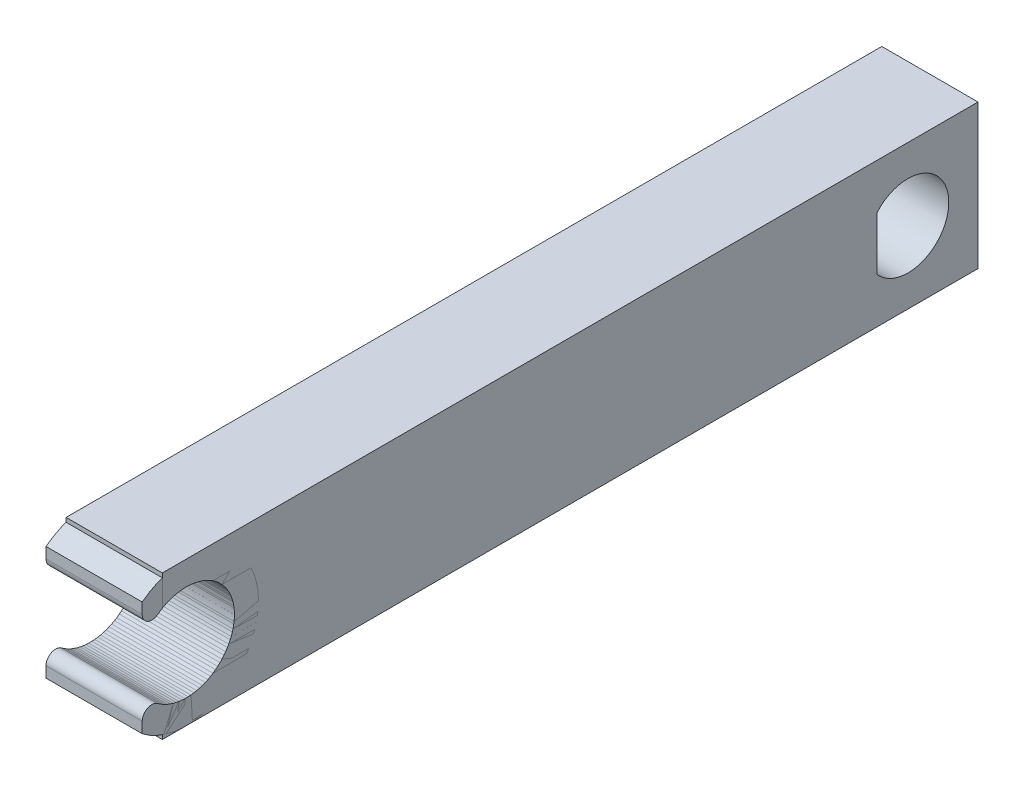
ISO-10303-21;
HEADER;
FILE_DESCRIPTION(('STEP AP214'),'2;1');
FILE_NAME('part.step','',(''),(''),'','','');
FILE_SCHEMA(('AUTOMOTIVE_DESIGN { 1 0 10303 214 1 1 1 1 }'));
ENDSEC;
DATA;
#1=APPLICATION_CONTEXT('core data for automotive mechanical design processes');
#2=APPLICATION_PROTOCOL_DEFINITION('international standard','automotive_design',2000,#1);
#3=PRODUCT_CONTEXT('',#1,'mechanical');
#4=PRODUCT('Part','Part','',(#3));
#5=PRODUCT_RELATED_PRODUCT_CATEGORY('part','',(#4));
#6=PRODUCT_DEFINITION_FORMATION('','',#4);
#7=PRODUCT_DEFINITION_CONTEXT('part definition',#1,'design');
#8=PRODUCT_DEFINITION('design','',#6,#7);
#9=PRODUCT_DEFINITION_SHAPE('','',#8);
#10=(LENGTH_UNIT() NAMED_UNIT(*) SI_UNIT(.MILLI.,.METRE.));
#11=(NAMED_UNIT(*) PLANE_ANGLE_UNIT() SI_UNIT($,.RADIAN.));
#12=(NAMED_UNIT(*) SI_UNIT($,.STERADIAN.) SOLID_ANGLE_UNIT());
#13=UNCERTAINTY_MEASURE_WITH_UNIT(LENGTH_MEASURE(1.E-05),#10,'distance_accuracy_value','');
#14=(GEOMETRIC_REPRESENTATION_CONTEXT(3) GLOBAL_UNCERTAINTY_ASSIGNED_CONTEXT((#13)) GLOBAL_UNIT_ASSIGNED_CONTEXT((#10,
#11,#12)) REPRESENTATION_CONTEXT('',''));
#15=CARTESIAN_POINT('',(0.,0.,0.));
#16=DIRECTION('',(0.,0.,1.));
#17=DIRECTION('',(1.,0.,0.));
#18=AXIS2_PLACEMENT_3D('',#15,#16,#17);
#19=CARTESIAN_POINT('',(-2.40602130027024,-18.3317262756318,80.));
#20=DIRECTION('',(-1.,0.,0.));
#21=DIRECTION('',(0.,-1.,0.));
#22=AXIS2_PLACEMENT_3D('',#19,#20,#21);
#23=CYLINDRICAL_SURFACE('',#22,6.);
#24=DIRECTION('',(-1.,0.,0.));
#25=VECTOR('',#24,1.);
#26=CARTESIAN_POINT('',(-2.40602130027024,-23.0751979656583,83.6741633504673));
#27=LINE('',#26,#25);
#28=CARTESIAN_POINT('',(-10.4060213002702,-23.0751979656583,83.6741633504673));
#29=VERTEX_POINT('',#28);
#30=CARTESIAN_POINT('',(-2.40602130027024,-23.0751979656583,83.6741633504673));
#31=VERTEX_POINT('',#30);
#32=EDGE_CURVE('E127',#29,#31,#27,.F.);
#33=ORIENTED_EDGE('',*,*,#32,.F.);
#34=CARTESIAN_POINT('',(-10.4060213002702,-18.3317262756318,80.));
#35=DIRECTION('',(-1.,0.,0.));
#36=DIRECTION('',(0.,-1.,0.));
#37=AXIS2_PLACEMENT_3D('',#34,#35,#36);
#38=CIRCLE('',#37,6.);
#39=CARTESIAN_POINT('',(-10.4060213002702,-13.5882545856054,83.6741633504673));
#40=VERTEX_POINT('',#39);
#41=EDGE_CURVE('E122',#40,#29,#38,.T.);
#42=ORIENTED_EDGE('',*,*,#41,.F.);
#43=DIRECTION('',(-1.,0.,0.));
#44=VECTOR('',#43,1.);
#45=CARTESIAN_POINT('',(-2.40602130027024,-13.5882545856054,83.6741633504673));
#46=LINE('',#45,#44);
#47=CARTESIAN_POINT('',(-2.40602130027024,-13.5882545856054,83.6741633504673));
#48=VERTEX_POINT('',#47);
#49=EDGE_CURVE('E108',#48,#40,#46,.T.);
#50=ORIENTED_EDGE('',*,*,#49,.F.);
#51=CARTESIAN_POINT('',(-2.40602130027024,-18.3317262756318,80.));
#52=DIRECTION('',(-1.,0.,0.));
#53=DIRECTION('',(0.,-1.,0.));
#54=AXIS2_PLACEMENT_3D('',#51,#52,#53);
#55=CIRCLE('',#54,6.);
#56=EDGE_CURVE('E128',#48,#31,#55,.T.);
#57=ORIENTED_EDGE('',*,*,#56,.T.);
#58=EDGE_LOOP('',(#33,#42,#50,#57));
#59=FACE_BOUND('',#58,.T.);
#60=ADVANCED_FACE('F55',(#59),#23,.T.);
#61=CARTESIAN_POINT('',(-2.40602130027024,-18.3317262756318,80.));
#62=DIRECTION('',(-1.,0.,0.));
#63=DIRECTION('',(0.,-1.,0.));
#64=AXIS2_PLACEMENT_3D('',#61,#62,#63);
#65=PLANE('',#64);
#66=CARTESIAN_POINT('',(-2.40602130027024,-18.3317262756318,80.));
#67=DIRECTION('',(-1.,0.,0.));
#68=DIRECTION('',(0.,-1.,0.));
#69=AXIS2_PLACEMENT_3D('',#66,#67,#68);
#70=CIRCLE('',#69,4.00000000000001);
#71=CARTESIAN_POINT('',(-2.40602130027024,-15.1280841388047,82.3951361253894));
#72=VERTEX_POINT('',#71);
#73=CARTESIAN_POINT('',(-2.40602130027024,-21.535368412459,82.3951361253894));
#74=VERTEX_POINT('',#73);
#75=EDGE_CURVE('E129',#72,#74,#70,.T.);
#76=ORIENTED_EDGE('',*,*,#75,.T.);
#77=CARTESIAN_POINT('',(-2.40602130027024,-22.1760968398244,82.8741633504673));
#78=DIRECTION('',(-1.,0.,0.));
#79=DIRECTION('',(0.,-1.,0.));
#80=AXIS2_PLACEMENT_3D('',#77,#78,#79);
#81=CIRCLE('',#80,0.8);
#82=CARTESIAN_POINT('',(-2.40602130027024,-22.1760968398244,83.6741633504673));
#83=VERTEX_POINT('',#82);
#84=EDGE_CURVE('E145',#74,#83,#81,.F.);
#85=ORIENTED_EDGE('',*,*,#84,.T.);
#86=DIRECTION('',(0.,-1.,0.));
#87=VECTOR('',#86,1.);
#88=CARTESIAN_POINT('',(-2.40602130027024,-18.3317262756318,83.6741633504673));
#89=LINE('',#88,#87);
#90=EDGE_CURVE('E118',#83,#31,#89,.T.);
#91=ORIENTED_EDGE('',*,*,#90,.T.);
#92=ORIENTED_EDGE('',*,*,#56,.F.);
#93=CARTESIAN_POINT('',(-2.40602130027024,-14.4873557114392,83.6741633504673));
#94=VERTEX_POINT('',#93);
#95=EDGE_CURVE('E113',#48,#94,#89,.T.);
#96=ORIENTED_EDGE('',*,*,#95,.T.);
#97=CARTESIAN_POINT('',(-2.40602130027024,-14.4873557114392,82.8741633504673));
#98=DIRECTION('',(-1.,0.,0.));
#99=DIRECTION('',(0.,-1.,0.));
#100=AXIS2_PLACEMENT_3D('',#97,#98,#99);
#101=CIRCLE('',#100,0.8);
#102=EDGE_CURVE('E143',#94,#72,#101,.F.);
#103=ORIENTED_EDGE('',*,*,#102,.T.);
#104=EDGE_LOOP('',(#76,#85,#91,#92,#96,#103));
#105=FACE_BOUND('',#104,.T.);
#106=ADVANCED_FACE('F158',(#105),#65,.F.);
#107=CARTESIAN_POINT('',(-10.4060213002702,-18.3317262756318,80.));
#108=DIRECTION('',(-1.,0.,0.));
#109=DIRECTION('',(0.,-1.,0.));
#110=AXIS2_PLACEMENT_3D('',#107,#108,#109);
#111=PLANE('',#110);
#112=DIRECTION('',(0.,-1.,0.));
#113=VECTOR('',#112,1.);
#114=CARTESIAN_POINT('',(-10.4060213002702,-12.3317262756318,83.6741633504673));
#115=LINE('',#114,#113);
#116=CARTESIAN_POINT('',(-10.4060213002702,-22.1760968398244,83.6741633504673));
#117=VERTEX_POINT('',#116);
#118=EDGE_CURVE('E123',#117,#29,#115,.T.);
#119=ORIENTED_EDGE('',*,*,#118,.F.);
#120=CARTESIAN_POINT('',(-10.4060213002702,-22.1760968398244,82.8741633504673));
#121=DIRECTION('',(-1.,0.,0.));
#122=DIRECTION('',(0.,-1.,0.));
#123=AXIS2_PLACEMENT_3D('',#120,#121,#122);
#124=CIRCLE('',#123,0.8);
#125=CARTESIAN_POINT('',(-10.4060213002702,-21.535368412459,82.3951361253894));
#126=VERTEX_POINT('',#125);
#127=EDGE_CURVE('E63',#117,#126,#124,.T.);
#128=ORIENTED_EDGE('',*,*,#127,.T.);
#129=CARTESIAN_POINT('',(-10.4060213002702,-18.3317262756318,80.));
#130=DIRECTION('',(-1.,0.,0.));
#131=DIRECTION('',(0.,-1.,0.));
#132=AXIS2_PLACEMENT_3D('',#129,#130,#131);
#133=CIRCLE('',#132,4.00000000000001);
#134=CARTESIAN_POINT('',(-10.4060213002702,-15.1280841388047,82.3951361253894));
#135=VERTEX_POINT('',#134);
#136=EDGE_CURVE('E134',#135,#126,#133,.T.);
#137=ORIENTED_EDGE('',*,*,#136,.F.);
#138=CARTESIAN_POINT('',(-10.4060213002702,-14.4873557114392,82.8741633504673));
#139=DIRECTION('',(-1.,0.,0.));
#140=DIRECTION('',(0.,-1.,0.));
#141=AXIS2_PLACEMENT_3D('',#138,#139,#140);
#142=CIRCLE('',#141,0.8);
#143=CARTESIAN_POINT('',(-10.4060213002702,-14.4873557114392,83.6741633504673));
#144=VERTEX_POINT('',#143);
#145=EDGE_CURVE('E70',#135,#144,#142,.T.);
#146=ORIENTED_EDGE('',*,*,#145,.T.);
#147=EDGE_CURVE('E110',#40,#144,#115,.T.);
#148=ORIENTED_EDGE('',*,*,#147,.F.);
#149=ORIENTED_EDGE('',*,*,#41,.T.);
#150=EDGE_LOOP('',(#119,#128,#137,#146,#148,#149));
#151=FACE_BOUND('',#150,.T.);
#152=ADVANCED_FACE('F121',(#151),#111,.T.);
#153=CARTESIAN_POINT('',(-2.40602130027024,-18.3317262756318,80.));
#154=DIRECTION('',(-1.,0.,0.));
#155=DIRECTION('',(0.,-1.,0.));
#156=AXIS2_PLACEMENT_3D('',#153,#154,#155);
#157=CYLINDRICAL_SURFACE('',#156,4.00000000000001);
#158=ORIENTED_EDGE('',*,*,#136,.T.);
#159=DIRECTION('',(-1.,0.,0.));
#160=VECTOR('',#159,1.);
#161=CARTESIAN_POINT('',(-2.40602130027024,-21.535368412459,82.3951361253894));
#162=LINE('',#161,#160);
#163=EDGE_CURVE('E140',#126,#74,#162,.F.);
#164=ORIENTED_EDGE('',*,*,#163,.T.);
#165=ORIENTED_EDGE('',*,*,#75,.F.);
#166=DIRECTION('',(-1.,0.,0.));
#167=VECTOR('',#166,1.);
#168=CARTESIAN_POINT('',(-2.40602130027024,-15.1280841388047,82.3951361253894));
#169=LINE('',#168,#167);
#170=EDGE_CURVE('E131',#72,#135,#169,.T.);
#171=ORIENTED_EDGE('',*,*,#170,.T.);
#172=EDGE_LOOP('',(#158,#164,#165,#171));
#173=FACE_BOUND('',#172,.T.);
#174=ADVANCED_FACE('F153',(#173),#157,.F.);
#175=CARTESIAN_POINT('',(33.5939786997298,-12.3317262756318,83.6741633504673));
#176=DIRECTION('',(0.,0.,-1.));
#177=DIRECTION('',(-1.,0.,0.));
#178=AXIS2_PLACEMENT_3D('',#175,#176,#177);
#179=PLANE('',#178);
#180=ORIENTED_EDGE('',*,*,#147,.T.);
#181=DIRECTION('',(-1.,0.,0.));
#182=VECTOR('',#181,1.);
#183=CARTESIAN_POINT('',(33.5939786997298,-14.4873557114392,83.6741633504673));
#184=LINE('',#183,#182);
#185=EDGE_CURVE('E13',#144,#94,#184,.F.);
#186=ORIENTED_EDGE('',*,*,#185,.T.);
#187=ORIENTED_EDGE('',*,*,#95,.F.);
#188=ORIENTED_EDGE('',*,*,#49,.T.);
#189=EDGE_LOOP('',(#180,#186,#187,#188));
#190=FACE_BOUND('',#189,.T.);
#191=ADVANCED_FACE('F109',(#190),#179,.F.);
#192=ORIENTED_EDGE('',*,*,#90,.F.);
#193=DIRECTION('',(-1.,0.,0.));
#194=VECTOR('',#193,1.);
#195=CARTESIAN_POINT('',(33.5939786997298,-22.1760968398244,83.6741633504673));
#196=LINE('',#195,#194);
#197=EDGE_CURVE('E78',#83,#117,#196,.T.);
#198=ORIENTED_EDGE('',*,*,#197,.T.);
#199=ORIENTED_EDGE('',*,*,#118,.T.);
#200=ORIENTED_EDGE('',*,*,#32,.T.);
#201=EDGE_LOOP('',(#192,#198,#199,#200));
#202=FACE_BOUND('',#201,.T.);
#203=ADVANCED_FACE('F159',(#202),#179,.F.);
#204=CARTESIAN_POINT('',(-2.40602130027024,-22.1760968398244,82.8741633504673));
#205=DIRECTION('',(-1.,0.,0.));
#206=DIRECTION('',(0.,-1.,0.));
#207=AXIS2_PLACEMENT_3D('',#204,#205,#206);
#208=CYLINDRICAL_SURFACE('',#207,0.8);
#209=ORIENTED_EDGE('',*,*,#127,.F.);
#210=ORIENTED_EDGE('',*,*,#197,.F.);
#211=ORIENTED_EDGE('',*,*,#84,.F.);
#212=ORIENTED_EDGE('',*,*,#163,.F.);
#213=EDGE_LOOP('',(#209,#210,#211,#212));
#214=FACE_BOUND('',#213,.T.);
#215=ADVANCED_FACE('F156',(#214),#208,.T.);
#216=CARTESIAN_POINT('',(-2.40602130027024,-14.4873557114392,82.8741633504673));
#217=DIRECTION('',(-1.,0.,0.));
#218=DIRECTION('',(0.,-1.,0.));
#219=AXIS2_PLACEMENT_3D('',#216,#217,#218);
#220=CYLINDRICAL_SURFACE('',#219,0.8);
#221=ORIENTED_EDGE('',*,*,#102,.F.);
#222=ORIENTED_EDGE('',*,*,#185,.F.);
#223=ORIENTED_EDGE('',*,*,#145,.F.);
#224=ORIENTED_EDGE('',*,*,#170,.F.);
#225=EDGE_LOOP('',(#221,#222,#223,#224));
#226=FACE_BOUND('',#225,.T.);
#227=ADVANCED_FACE('F57',(#226),#220,.T.);
#228=CLOSED_SHELL('',(#60,#106,#152,#174,#191,#203,#215,#227));
#229=MANIFOLD_SOLID_BREP('B2',#228);
#230=CARTESIAN_POINT('',(-10.4060213002702,-12.3317262756318,82.));
#231=DIRECTION('',(1.,0.,0.));
#232=DIRECTION('',(0.,1.,0.));
#233=AXIS2_PLACEMENT_3D('',#230,#231,#232);
#234=PLANE('',#233);
#235=DIRECTION('',(0.,-1.,0.));
#236=VECTOR('',#235,1.);
#237=CARTESIAN_POINT('',(-10.4060213002702,0.,22.5559386762542));
#238=LINE('',#237,#236);
#239=CARTESIAN_POINT('',(-10.4060213002702,-16.0895894637428,22.5559386762542));
#240=VERTEX_POINT('',#239);
#241=CARTESIAN_POINT('',(-10.4060213002702,-20.5738630875209,22.5559386762542));
#242=VERTEX_POINT('',#241);
#243=EDGE_CURVE('E255',#240,#242,#238,.T.);
#244=ORIENTED_EDGE('',*,*,#243,.T.);
#245=CARTESIAN_POINT('',(-10.4060213002702,-18.3317262756318,20.));
#246=DIRECTION('',(-1.,0.,0.));
#247=DIRECTION('',(0.,-1.,0.));
#248=AXIS2_PLACEMENT_3D('',#245,#246,#247);
#249=CIRCLE('',#248,3.4);
#250=EDGE_CURVE('E379',#240,#242,#249,.T.);
#251=ORIENTED_EDGE('',*,*,#250,.F.);
#252=EDGE_LOOP('',(#244,#251));
#253=FACE_BOUND('',#252,.T.);
#254=DIRECTION('',(0.,-1.,0.));
#255=VECTOR('',#254,1.);
#256=CARTESIAN_POINT('',(-10.4060213002702,0.,14.1719817502576));
#257=LINE('',#256,#255);
#258=CARTESIAN_POINT('',(-10.4060213002702,-12.3317262756318,14.1719817502576));
#259=VERTEX_POINT('',#258);
#260=CARTESIAN_POINT('',(-10.4060213002702,-24.3317262756318,14.1719817502576));
#261=VERTEX_POINT('',#260);
#262=EDGE_CURVE('E307',#259,#261,#257,.T.);
#263=ORIENTED_EDGE('',*,*,#262,.T.);
#264=DIRECTION('',(0.,0.,-1.));
#265=VECTOR('',#264,1.);
#266=CARTESIAN_POINT('',(-10.4060213002702,-24.3317262756318,82.));
#267=LINE('',#266,#265);
#268=CARTESIAN_POINT('',(-10.4060213002702,-24.3317262756318,82.));
#269=VERTEX_POINT('',#268);
#270=EDGE_CURVE('E322',#269,#261,#267,.T.);
#271=ORIENTED_EDGE('',*,*,#270,.F.);
#272=DIRECTION('',(0.,-1.,0.));
#273=VECTOR('',#272,1.);
#274=CARTESIAN_POINT('',(-10.4060213002702,-12.3317262756318,82.));
#275=LINE('',#274,#273);
#276=CARTESIAN_POINT('',(-10.4060213002702,-21.7958278907696,82.));
#277=VERTEX_POINT('',#276);
#278=EDGE_CURVE('E359',#277,#269,#275,.T.);
#279=ORIENTED_EDGE('',*,*,#278,.F.);
#280=CARTESIAN_POINT('',(-10.4060213002702,-18.3317262756318,80.));
#281=DIRECTION('',(-1.,0.,0.));
#282=DIRECTION('',(0.,-1.,0.));
#283=AXIS2_PLACEMENT_3D('',#280,#281,#282);
#284=CIRCLE('',#283,4.00000000000001);
#285=CARTESIAN_POINT('',(-10.4060213002702,-14.8676246604941,82.));
#286=VERTEX_POINT('',#285);
#287=EDGE_CURVE('E368',#286,#277,#284,.T.);
#288=ORIENTED_EDGE('',*,*,#287,.F.);
#289=CARTESIAN_POINT('',(-10.4060213002702,-12.3317262756318,82.));
#290=VERTEX_POINT('',#289);
#291=EDGE_CURVE('E355',#290,#286,#275,.T.);
#292=ORIENTED_EDGE('',*,*,#291,.F.);
#293=DIRECTION('',(0.,0.,-1.));
#294=VECTOR('',#293,1.);
#295=CARTESIAN_POINT('',(-10.4060213002702,-12.3317262756318,82.));
#296=LINE('',#295,#294);
#297=EDGE_CURVE('E325',#290,#259,#296,.T.);
#298=ORIENTED_EDGE('',*,*,#297,.T.);
#299=EDGE_LOOP('',(#263,#271,#279,#288,#292,#298));
#300=FACE_BOUND('',#299,.T.);
#301=ADVANCED_FACE('F240',(#253,#300),#234,.F.);
#302=CARTESIAN_POINT('',(-10.4060213002702,-24.3317262756318,82.));
#303=DIRECTION('',(0.,1.,0.));
#304=DIRECTION('',(0.,0.,1.));
#305=AXIS2_PLACEMENT_3D('',#302,#303,#304);
#306=PLANE('',#305);
#307=DIRECTION('',(-1.,0.,0.));
#308=VECTOR('',#307,1.);
#309=CARTESIAN_POINT('',(-0.406021300270239,-24.3317262756318,14.1719817502576));
#310=LINE('',#309,#308);
#311=CARTESIAN_POINT('',(-2.40602130027024,-24.3317262756318,14.1719817502576));
#312=VERTEX_POINT('',#311);
#313=EDGE_CURVE('E304',#312,#261,#310,.T.);
#314=ORIENTED_EDGE('',*,*,#313,.F.);
#315=DIRECTION('',(0.,0.,-1.));
#316=VECTOR('',#315,1.);
#317=CARTESIAN_POINT('',(-2.40602130027024,-24.3317262756318,82.));
#318=LINE('',#317,#316);
#319=CARTESIAN_POINT('',(-2.40602130027024,-24.3317262756318,82.));
#320=VERTEX_POINT('',#319);
#321=EDGE_CURVE('E332',#320,#312,#318,.T.);
#322=ORIENTED_EDGE('',*,*,#321,.F.);
#323=DIRECTION('',(1.,0.,0.));
#324=VECTOR('',#323,1.);
#325=CARTESIAN_POINT('',(-10.4060213002702,-24.3317262756318,82.));
#326=LINE('',#325,#324);
#327=EDGE_CURVE('E330',#269,#320,#326,.T.);
#328=ORIENTED_EDGE('',*,*,#327,.F.);
#329=ORIENTED_EDGE('',*,*,#270,.T.);
#330=EDGE_LOOP('',(#314,#322,#328,#329));
#331=FACE_BOUND('',#330,.T.);
#332=ADVANCED_FACE('F329',(#331),#306,.F.);
#333=CARTESIAN_POINT('',(-2.40602130027024,-12.3317262756318,82.));
#334=DIRECTION('',(-1.,0.,0.));
#335=DIRECTION('',(0.,-1.,0.));
#336=AXIS2_PLACEMENT_3D('',#333,#334,#335);
#337=PLANE('',#336);
#338=DIRECTION('',(0.,-1.,0.));
#339=VECTOR('',#338,1.);
#340=CARTESIAN_POINT('',(-2.40602130027024,-12.3317262756318,22.5559386762542));
#341=LINE('',#340,#339);
#342=CARTESIAN_POINT('',(-2.40602130027024,-16.0895894637428,22.5559386762542));
#343=VERTEX_POINT('',#342);
#344=CARTESIAN_POINT('',(-2.40602130027024,-20.5738630875209,22.5559386762542));
#345=VERTEX_POINT('',#344);
#346=EDGE_CURVE('E53',#343,#345,#341,.T.);
#347=ORIENTED_EDGE('',*,*,#346,.F.);
#348=CARTESIAN_POINT('',(-2.40602130027024,-18.3317262756318,20.));
#349=DIRECTION('',(-1.,0.,0.));
#350=DIRECTION('',(0.,-1.,0.));
#351=AXIS2_PLACEMENT_3D('',#348,#349,#350);
#352=CIRCLE('',#351,3.4);
#353=EDGE_CURVE('E248',#343,#345,#352,.T.);
#354=ORIENTED_EDGE('',*,*,#353,.T.);
#355=EDGE_LOOP('',(#347,#354));
#356=FACE_BOUND('',#355,.T.);
#357=DIRECTION('',(0.,-1.,0.));
#358=VECTOR('',#357,1.);
#359=CARTESIAN_POINT('',(-2.40602130027024,-12.3317262756318,14.1719817502576));
#360=LINE('',#359,#358);
#361=CARTESIAN_POINT('',(-2.40602130027024,-12.3317262756318,14.1719817502576));
#362=VERTEX_POINT('',#361);
#363=EDGE_CURVE('E310',#362,#312,#360,.T.);
#364=ORIENTED_EDGE('',*,*,#363,.F.);
#365=DIRECTION('',(0.,0.,-1.));
#366=VECTOR('',#365,1.);
#367=CARTESIAN_POINT('',(-2.40602130027024,-12.3317262756318,82.));
#368=LINE('',#367,#366);
#369=CARTESIAN_POINT('',(-2.40602130027024,-12.3317262756318,82.));
#370=VERTEX_POINT('',#369);
#371=EDGE_CURVE('E337',#370,#362,#368,.T.);
#372=ORIENTED_EDGE('',*,*,#371,.F.);
#373=DIRECTION('',(0.,1.,0.));
#374=VECTOR('',#373,1.);
#375=CARTESIAN_POINT('',(-2.40602130027024,-12.3317262756318,82.));
#376=LINE('',#375,#374);
#377=CARTESIAN_POINT('',(-2.40602130027024,-14.8676246604941,82.));
#378=VERTEX_POINT('',#377);
#379=EDGE_CURVE('E352',#378,#370,#376,.T.);
#380=ORIENTED_EDGE('',*,*,#379,.F.);
#381=CARTESIAN_POINT('',(-2.40602130027024,-18.3317262756318,80.));
#382=DIRECTION('',(-1.,0.,0.));
#383=DIRECTION('',(0.,-1.,0.));
#384=AXIS2_PLACEMENT_3D('',#381,#382,#383);
#385=CIRCLE('',#384,4.00000000000001);
#386=CARTESIAN_POINT('',(-2.40602130027024,-21.7958278907696,82.));
#387=VERTEX_POINT('',#386);
#388=EDGE_CURVE('E364',#378,#387,#385,.T.);
#389=ORIENTED_EDGE('',*,*,#388,.T.);
#390=EDGE_CURVE('E348',#320,#387,#376,.T.);
#391=ORIENTED_EDGE('',*,*,#390,.F.);
#392=ORIENTED_EDGE('',*,*,#321,.T.);
#393=EDGE_LOOP('',(#364,#372,#380,#389,#391,#392));
#394=FACE_BOUND('',#393,.T.);
#395=ADVANCED_FACE('F392',(#356,#394),#337,.F.);
#396=CARTESIAN_POINT('',(-10.4060213002702,-12.3317262756318,82.));
#397=DIRECTION('',(0.,-1.,0.));
#398=DIRECTION('',(0.,0.,-1.));
#399=AXIS2_PLACEMENT_3D('',#396,#397,#398);
#400=PLANE('',#399);
#401=DIRECTION('',(-1.,0.,0.));
#402=VECTOR('',#401,1.);
#403=CARTESIAN_POINT('',(-0.40602130027024,-12.3317262756318,14.1719817502576));
#404=LINE('',#403,#402);
#405=EDGE_CURVE('E316',#362,#259,#404,.T.);
#406=ORIENTED_EDGE('',*,*,#405,.T.);
#407=ORIENTED_EDGE('',*,*,#297,.F.);
#408=DIRECTION('',(-1.,0.,0.));
#409=VECTOR('',#408,1.);
#410=CARTESIAN_POINT('',(-10.4060213002702,-12.3317262756318,82.));
#411=LINE('',#410,#409);
#412=EDGE_CURVE('E345',#370,#290,#411,.T.);
#413=ORIENTED_EDGE('',*,*,#412,.F.);
#414=ORIENTED_EDGE('',*,*,#371,.T.);
#415=EDGE_LOOP('',(#406,#407,#413,#414));
#416=FACE_BOUND('',#415,.T.);
#417=ADVANCED_FACE('F388',(#416),#400,.F.);
#418=CARTESIAN_POINT('',(0.,0.,82.));
#419=DIRECTION('',(0.,0.,1.));
#420=DIRECTION('',(1.,0.,0.));
#421=AXIS2_PLACEMENT_3D('',#418,#419,#420);
#422=PLANE('',#421);
#423=DIRECTION('',(-1.,0.,0.));
#424=VECTOR('',#423,1.);
#425=CARTESIAN_POINT('',(-2.40602130027024,-14.8676246604941,82.));
#426=LINE('',#425,#424);
#427=EDGE_CURVE('E360',#378,#286,#426,.T.);
#428=ORIENTED_EDGE('',*,*,#427,.F.);
#429=ORIENTED_EDGE('',*,*,#379,.T.);
#430=ORIENTED_EDGE('',*,*,#412,.T.);
#431=ORIENTED_EDGE('',*,*,#291,.T.);
#432=EDGE_LOOP('',(#428,#429,#430,#431));
#433=FACE_BOUND('',#432,.T.);
#434=ADVANCED_FACE('F402',(#433),#422,.T.);
#435=DIRECTION('',(-1.,0.,0.));
#436=VECTOR('',#435,1.);
#437=CARTESIAN_POINT('',(-2.40602130027024,-21.7958278907696,82.));
#438=LINE('',#437,#436);
#439=EDGE_CURVE('E363',#387,#277,#438,.T.);
#440=ORIENTED_EDGE('',*,*,#439,.T.);
#441=ORIENTED_EDGE('',*,*,#278,.T.);
#442=ORIENTED_EDGE('',*,*,#327,.T.);
#443=ORIENTED_EDGE('',*,*,#390,.T.);
#444=EDGE_LOOP('',(#440,#441,#442,#443));
#445=FACE_BOUND('',#444,.T.);
#446=ADVANCED_FACE('F396',(#445),#422,.T.);
#447=CARTESIAN_POINT('',(-2.40602130027024,-18.3317262756318,80.));
#448=DIRECTION('',(-1.,0.,0.));
#449=DIRECTION('',(0.,-1.,0.));
#450=AXIS2_PLACEMENT_3D('',#447,#448,#449);
#451=CYLINDRICAL_SURFACE('',#450,4.00000000000001);
#452=ORIENTED_EDGE('',*,*,#287,.T.);
#453=ORIENTED_EDGE('',*,*,#439,.F.);
#454=ORIENTED_EDGE('',*,*,#388,.F.);
#455=ORIENTED_EDGE('',*,*,#427,.T.);
#456=EDGE_LOOP('',(#452,#453,#454,#455));
#457=FACE_BOUND('',#456,.T.);
#458=ADVANCED_FACE('F404',(#457),#451,.F.);
#459=CARTESIAN_POINT('',(-0.406021300270242,0.,14.1719817502576));
#460=DIRECTION('',(0.,0.,-1.));
#461=DIRECTION('',(-1.,0.,0.));
#462=AXIS2_PLACEMENT_3D('',#459,#460,#461);
#463=PLANE('',#462);
#464=ORIENTED_EDGE('',*,*,#363,.T.);
#465=ORIENTED_EDGE('',*,*,#313,.T.);
#466=ORIENTED_EDGE('',*,*,#262,.F.);
#467=ORIENTED_EDGE('',*,*,#405,.F.);
#468=EDGE_LOOP('',(#464,#465,#466,#467));
#469=FACE_BOUND('',#468,.T.);
#470=ADVANCED_FACE('F306',(#469),#463,.T.);
#471=CARTESIAN_POINT('',(-0.406021300270242,0.,22.5559386762542));
#472=DIRECTION('',(0.,0.,-1.));
#473=DIRECTION('',(-1.,0.,0.));
#474=AXIS2_PLACEMENT_3D('',#471,#472,#473);
#475=PLANE('',#474);
#476=ORIENTED_EDGE('',*,*,#346,.T.);
#477=DIRECTION('',(-1.,0.,0.));
#478=VECTOR('',#477,1.);
#479=CARTESIAN_POINT('',(-0.406021300270239,-20.5738630875209,22.5559386762542));
#480=LINE('',#479,#478);
#481=EDGE_CURVE('E262',#345,#242,#480,.T.);
#482=ORIENTED_EDGE('',*,*,#481,.T.);
#483=ORIENTED_EDGE('',*,*,#243,.F.);
#484=DIRECTION('',(-1.,0.,0.));
#485=VECTOR('',#484,1.);
#486=CARTESIAN_POINT('',(-0.40602130027024,-16.0895894637428,22.5559386762542));
#487=LINE('',#486,#485);
#488=EDGE_CURVE('E376',#343,#240,#487,.T.);
#489=ORIENTED_EDGE('',*,*,#488,.F.);
#490=EDGE_LOOP('',(#476,#482,#483,#489));
#491=FACE_BOUND('',#490,.T.);
#492=ADVANCED_FACE('F411',(#491),#475,.T.);
#493=CARTESIAN_POINT('',(-0.40602130027024,-18.3317262756318,20.));
#494=DIRECTION('',(-1.,0.,0.));
#495=DIRECTION('',(0.,-1.,0.));
#496=AXIS2_PLACEMENT_3D('',#493,#494,#495);
#497=CYLINDRICAL_SURFACE('',#496,3.4);
#498=ORIENTED_EDGE('',*,*,#488,.T.);
#499=ORIENTED_EDGE('',*,*,#250,.T.);
#500=ORIENTED_EDGE('',*,*,#481,.F.);
#501=ORIENTED_EDGE('',*,*,#353,.F.);
#502=EDGE_LOOP('',(#498,#499,#500,#501));
#503=FACE_BOUND('',#502,.T.);
#504=ADVANCED_FACE('F421',(#503),#497,.F.);
#505=CLOSED_SHELL('',(#301,#332,#395,#417,#434,#446,#458,#470,#492,#504));
#506=MANIFOLD_SOLID_BREP('B7',#505);
#507=ADVANCED_BREP_SHAPE_REPRESENTATION('',(#18,#229,#506),#14);
#508=SHAPE_DEFINITION_REPRESENTATION(#9,#507);
ENDSEC;
END-ISO-10303-21;
